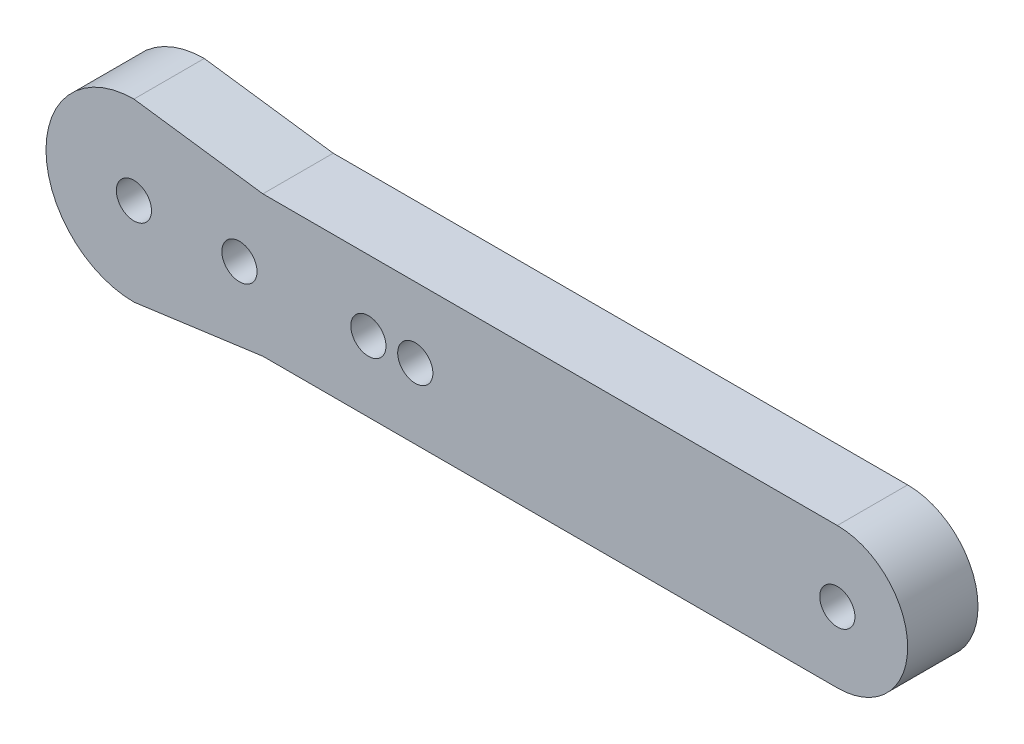
ISO-10303-21;
HEADER;
FILE_DESCRIPTION(('STEP AP214'),'2;1');
FILE_NAME('part.step','',(''),(''),'','','');
FILE_SCHEMA(('AUTOMOTIVE_DESIGN { 1 0 10303 214 1 1 1 1 }'));
ENDSEC;
DATA;
#1=APPLICATION_CONTEXT('core data for automotive mechanical design processes');
#2=APPLICATION_PROTOCOL_DEFINITION('international standard','automotive_design',2000,#1);
#3=PRODUCT_CONTEXT('',#1,'mechanical');
#4=PRODUCT('Part','Part','',(#3));
#5=PRODUCT_RELATED_PRODUCT_CATEGORY('part','',(#4));
#6=PRODUCT_DEFINITION_FORMATION('','',#4);
#7=PRODUCT_DEFINITION_CONTEXT('part definition',#1,'design');
#8=PRODUCT_DEFINITION('design','',#6,#7);
#9=PRODUCT_DEFINITION_SHAPE('','',#8);
#10=(LENGTH_UNIT() NAMED_UNIT(*) SI_UNIT(.MILLI.,.METRE.));
#11=(NAMED_UNIT(*) PLANE_ANGLE_UNIT() SI_UNIT($,.RADIAN.));
#12=(NAMED_UNIT(*) SI_UNIT($,.STERADIAN.) SOLID_ANGLE_UNIT());
#13=UNCERTAINTY_MEASURE_WITH_UNIT(LENGTH_MEASURE(1.E-05),#10,'distance_accuracy_value','');
#14=(GEOMETRIC_REPRESENTATION_CONTEXT(3) GLOBAL_UNCERTAINTY_ASSIGNED_CONTEXT((#13)) GLOBAL_UNIT_ASSIGNED_CONTEXT((#10,
#11,#12)) REPRESENTATION_CONTEXT('',''));
#15=CARTESIAN_POINT('',(0.,0.,0.));
#16=DIRECTION('',(0.,0.,1.));
#17=DIRECTION('',(1.,0.,0.));
#18=AXIS2_PLACEMENT_3D('',#15,#16,#17);
#19=CARTESIAN_POINT('',(0.,-6.,6.));
#20=DIRECTION('',(0.,1.,0.));
#21=DIRECTION('',(0.,0.,1.));
#22=AXIS2_PLACEMENT_3D('',#19,#20,#21);
#23=PLANE('',#22);
#24=DIRECTION('',(0.,0.,-1.));
#25=VECTOR('',#24,1.);
#26=CARTESIAN_POINT('',(11.,-6.,29.8170107276291));
#27=LINE('',#26,#25);
#28=CARTESIAN_POINT('',(11.,-6.,6.));
#29=VERTEX_POINT('',#28);
#30=CARTESIAN_POINT('',(11.,-6.,0.));
#31=VERTEX_POINT('',#30);
#32=EDGE_CURVE('E129',#29,#31,#27,.T.);
#33=ORIENTED_EDGE('',*,*,#32,.T.);
#34=DIRECTION('',(1.,0.,0.));
#35=VECTOR('',#34,1.);
#36=CARTESIAN_POINT('',(0.,-6.,0.));
#37=LINE('',#36,#35);
#38=CARTESIAN_POINT('',(60.,-6.,0.));
#39=VERTEX_POINT('',#38);
#40=EDGE_CURVE('E181',#31,#39,#37,.T.);
#41=ORIENTED_EDGE('',*,*,#40,.T.);
#42=DIRECTION('',(0.,0.,-1.));
#43=VECTOR('',#42,1.);
#44=CARTESIAN_POINT('',(60.,-6.,6.));
#45=LINE('',#44,#43);
#46=CARTESIAN_POINT('',(60.,-6.,6.));
#47=VERTEX_POINT('',#46);
#48=EDGE_CURVE('E11',#47,#39,#45,.T.);
#49=ORIENTED_EDGE('',*,*,#48,.F.);
#50=DIRECTION('',(1.,0.,0.));
#51=VECTOR('',#50,1.);
#52=CARTESIAN_POINT('',(0.,-6.,6.));
#53=LINE('',#52,#51);
#54=EDGE_CURVE('E70',#29,#47,#53,.T.);
#55=ORIENTED_EDGE('',*,*,#54,.F.);
#56=EDGE_LOOP('',(#33,#41,#49,#55));
#57=FACE_BOUND('',#56,.T.);
#58=ADVANCED_FACE('F47',(#57),#23,.F.);
#59=CARTESIAN_POINT('',(0.,6.,6.));
#60=DIRECTION('',(0.,-1.,0.));
#61=DIRECTION('',(0.,0.,-1.));
#62=AXIS2_PLACEMENT_3D('',#59,#60,#61);
#63=PLANE('',#62);
#64=DIRECTION('',(0.,0.,-1.));
#65=VECTOR('',#64,1.);
#66=CARTESIAN_POINT('',(11.,6.,29.8170107276291));
#67=LINE('',#66,#65);
#68=CARTESIAN_POINT('',(11.,6.,6.));
#69=VERTEX_POINT('',#68);
#70=CARTESIAN_POINT('',(11.,6.,0.));
#71=VERTEX_POINT('',#70);
#72=EDGE_CURVE('E62',#69,#71,#67,.T.);
#73=ORIENTED_EDGE('',*,*,#72,.F.);
#74=DIRECTION('',(-1.,0.,0.));
#75=VECTOR('',#74,1.);
#76=CARTESIAN_POINT('',(0.,6.,6.));
#77=LINE('',#76,#75);
#78=CARTESIAN_POINT('',(60.,6.,6.));
#79=VERTEX_POINT('',#78);
#80=EDGE_CURVE('E127',#79,#69,#77,.T.);
#81=ORIENTED_EDGE('',*,*,#80,.F.);
#82=DIRECTION('',(0.,0.,-1.));
#83=VECTOR('',#82,1.);
#84=CARTESIAN_POINT('',(60.,6.,6.));
#85=LINE('',#84,#83);
#86=CARTESIAN_POINT('',(60.,6.,0.));
#87=VERTEX_POINT('',#86);
#88=EDGE_CURVE('E55',#79,#87,#85,.T.);
#89=ORIENTED_EDGE('',*,*,#88,.T.);
#90=DIRECTION('',(-1.,0.,0.));
#91=VECTOR('',#90,1.);
#92=CARTESIAN_POINT('',(0.,6.,0.));
#93=LINE('',#92,#91);
#94=EDGE_CURVE('E185',#87,#71,#93,.T.);
#95=ORIENTED_EDGE('',*,*,#94,.T.);
#96=EDGE_LOOP('',(#73,#81,#89,#95));
#97=FACE_BOUND('',#96,.T.);
#98=ADVANCED_FACE('F199',(#97),#63,.F.);
#99=CARTESIAN_POINT('',(60.,0.,6.));
#100=DIRECTION('',(0.,0.,-1.));
#101=DIRECTION('',(-1.,0.,0.));
#102=AXIS2_PLACEMENT_3D('',#99,#100,#101);
#103=CYLINDRICAL_SURFACE('',#102,6.);
#104=CARTESIAN_POINT('',(60.,0.,0.));
#105=DIRECTION('',(0.,0.,1.));
#106=DIRECTION('',(1.,0.,0.));
#107=AXIS2_PLACEMENT_3D('',#104,#105,#106);
#108=CIRCLE('',#107,6.);
#109=EDGE_CURVE('E191',#39,#87,#108,.T.);
#110=ORIENTED_EDGE('',*,*,#109,.T.);
#111=ORIENTED_EDGE('',*,*,#88,.F.);
#112=CARTESIAN_POINT('',(60.,0.,6.));
#113=DIRECTION('',(0.,0.,1.));
#114=DIRECTION('',(1.,0.,0.));
#115=AXIS2_PLACEMENT_3D('',#112,#113,#114);
#116=CIRCLE('',#115,6.);
#117=EDGE_CURVE('E184',#47,#79,#116,.T.);
#118=ORIENTED_EDGE('',*,*,#117,.F.);
#119=ORIENTED_EDGE('',*,*,#48,.T.);
#120=EDGE_LOOP('',(#110,#111,#118,#119));
#121=FACE_BOUND('',#120,.T.);
#122=ADVANCED_FACE('F215',(#121),#103,.T.);
#123=CARTESIAN_POINT('',(0.,0.,6.));
#124=DIRECTION('',(0.,0.,1.));
#125=DIRECTION('',(1.,0.,0.));
#126=AXIS2_PLACEMENT_3D('',#123,#124,#125);
#127=PLANE('',#126);
#128=ORIENTED_EDGE('',*,*,#80,.T.);
#129=DIRECTION('',(-0.990830168044299,0.135113204733313,0.));
#130=VECTOR('',#129,1.);
#131=CARTESIAN_POINT('',(0.,7.5,6.));
#132=LINE('',#131,#130);
#133=CARTESIAN_POINT('',(0.,7.5,6.));
#134=VERTEX_POINT('',#133);
#135=EDGE_CURVE('E114',#69,#134,#132,.T.);
#136=ORIENTED_EDGE('',*,*,#135,.T.);
#137=CARTESIAN_POINT('',(0.,0.,6.));
#138=DIRECTION('',(0.,0.,1.));
#139=DIRECTION('',(1.,0.,0.));
#140=AXIS2_PLACEMENT_3D('',#137,#138,#139);
#141=CIRCLE('',#140,7.5);
#142=CARTESIAN_POINT('',(0.,-7.5,6.));
#143=VERTEX_POINT('',#142);
#144=EDGE_CURVE('E102',#134,#143,#141,.T.);
#145=ORIENTED_EDGE('',*,*,#144,.T.);
#146=DIRECTION('',(0.990830168044299,0.135113204733313,0.));
#147=VECTOR('',#146,1.);
#148=CARTESIAN_POINT('',(0.,-7.5,6.));
#149=LINE('',#148,#147);
#150=EDGE_CURVE('E113',#143,#29,#149,.T.);
#151=ORIENTED_EDGE('',*,*,#150,.T.);
#152=ORIENTED_EDGE('',*,*,#54,.T.);
#153=ORIENTED_EDGE('',*,*,#117,.T.);
#154=EDGE_LOOP('',(#128,#136,#145,#151,#152,#153));
#155=FACE_BOUND('',#154,.T.);
#156=CARTESIAN_POINT('',(0.,0.,6.));
#157=DIRECTION('',(0.,0.,1.));
#158=DIRECTION('',(1.,0.,0.));
#159=AXIS2_PLACEMENT_3D('',#156,#157,#158);
#160=CIRCLE('',#159,1.5);
#161=CARTESIAN_POINT('',(1.5,0.,6.));
#162=VERTEX_POINT('',#161);
#163=EDGE_CURVE('E141',#162,#162,#160,.T.);
#164=ORIENTED_EDGE('',*,*,#163,.F.);
#165=EDGE_LOOP('',(#164));
#166=FACE_BOUND('',#165,.T.);
#167=CARTESIAN_POINT('',(60.,0.,6.));
#168=DIRECTION('',(0.,0.,1.));
#169=DIRECTION('',(1.,0.,0.));
#170=AXIS2_PLACEMENT_3D('',#167,#168,#169);
#171=CIRCLE('',#170,1.5);
#172=CARTESIAN_POINT('',(61.5,0.,6.));
#173=VERTEX_POINT('',#172);
#174=EDGE_CURVE('E149',#173,#173,#171,.T.);
#175=ORIENTED_EDGE('',*,*,#174,.F.);
#176=EDGE_LOOP('',(#175));
#177=FACE_BOUND('',#176,.T.);
#178=CARTESIAN_POINT('',(9.,0.,6.));
#179=DIRECTION('',(0.,0.,1.));
#180=DIRECTION('',(1.,0.,0.));
#181=AXIS2_PLACEMENT_3D('',#178,#179,#180);
#182=CIRCLE('',#181,1.5);
#183=CARTESIAN_POINT('',(10.5,0.,6.));
#184=VERTEX_POINT('',#183);
#185=EDGE_CURVE('E157',#184,#184,#182,.T.);
#186=ORIENTED_EDGE('',*,*,#185,.F.);
#187=EDGE_LOOP('',(#186));
#188=FACE_BOUND('',#187,.T.);
#189=CARTESIAN_POINT('',(20.,0.,6.));
#190=DIRECTION('',(0.,0.,1.));
#191=DIRECTION('',(1.,0.,0.));
#192=AXIS2_PLACEMENT_3D('',#189,#190,#191);
#193=CIRCLE('',#192,1.5);
#194=CARTESIAN_POINT('',(21.5,0.,6.));
#195=VERTEX_POINT('',#194);
#196=EDGE_CURVE('E165',#195,#195,#193,.T.);
#197=ORIENTED_EDGE('',*,*,#196,.F.);
#198=EDGE_LOOP('',(#197));
#199=FACE_BOUND('',#198,.T.);
#200=CARTESIAN_POINT('',(24.,0.,6.));
#201=DIRECTION('',(0.,0.,1.));
#202=DIRECTION('',(1.,0.,0.));
#203=AXIS2_PLACEMENT_3D('',#200,#201,#202);
#204=CIRCLE('',#203,1.5);
#205=CARTESIAN_POINT('',(25.5,0.,6.));
#206=VERTEX_POINT('',#205);
#207=EDGE_CURVE('E173',#206,#206,#204,.T.);
#208=ORIENTED_EDGE('',*,*,#207,.F.);
#209=EDGE_LOOP('',(#208));
#210=FACE_BOUND('',#209,.T.);
#211=ADVANCED_FACE('F125',(#155,#166,#177,#188,#199,#210),#127,.T.);
#212=CARTESIAN_POINT('',(0.,0.,0.));
#213=DIRECTION('',(0.,0.,1.));
#214=DIRECTION('',(1.,0.,0.));
#215=AXIS2_PLACEMENT_3D('',#212,#213,#214);
#216=PLANE('',#215);
#217=DIRECTION('',(-0.990830168044299,0.135113204733313,0.));
#218=VECTOR('',#217,1.);
#219=CARTESIAN_POINT('',(0.,7.5,0.));
#220=LINE('',#219,#218);
#221=CARTESIAN_POINT('',(0.,7.5,0.));
#222=VERTEX_POINT('',#221);
#223=EDGE_CURVE('E120',#71,#222,#220,.T.);
#224=ORIENTED_EDGE('',*,*,#223,.F.);
#225=ORIENTED_EDGE('',*,*,#94,.F.);
#226=ORIENTED_EDGE('',*,*,#109,.F.);
#227=ORIENTED_EDGE('',*,*,#40,.F.);
#228=DIRECTION('',(0.990830168044299,0.135113204733313,0.));
#229=VECTOR('',#228,1.);
#230=CARTESIAN_POINT('',(0.,-7.5,0.));
#231=LINE('',#230,#229);
#232=CARTESIAN_POINT('',(0.,-7.5,0.));
#233=VERTEX_POINT('',#232);
#234=EDGE_CURVE('E134',#233,#31,#231,.T.);
#235=ORIENTED_EDGE('',*,*,#234,.F.);
#236=CARTESIAN_POINT('',(0.,0.,0.));
#237=DIRECTION('',(0.,0.,1.));
#238=DIRECTION('',(1.,0.,0.));
#239=AXIS2_PLACEMENT_3D('',#236,#237,#238);
#240=CIRCLE('',#239,7.5);
#241=EDGE_CURVE('E123',#222,#233,#240,.T.);
#242=ORIENTED_EDGE('',*,*,#241,.F.);
#243=EDGE_LOOP('',(#224,#225,#226,#227,#235,#242));
#244=FACE_BOUND('',#243,.T.);
#245=CARTESIAN_POINT('',(0.,0.,0.));
#246=DIRECTION('',(0.,0.,1.));
#247=DIRECTION('',(1.,0.,0.));
#248=AXIS2_PLACEMENT_3D('',#245,#246,#247);
#249=CIRCLE('',#248,1.5);
#250=CARTESIAN_POINT('',(1.5,0.,0.));
#251=VERTEX_POINT('',#250);
#252=EDGE_CURVE('E145',#251,#251,#249,.T.);
#253=ORIENTED_EDGE('',*,*,#252,.T.);
#254=EDGE_LOOP('',(#253));
#255=FACE_BOUND('',#254,.T.);
#256=CARTESIAN_POINT('',(60.,0.,0.));
#257=DIRECTION('',(0.,0.,1.));
#258=DIRECTION('',(1.,0.,0.));
#259=AXIS2_PLACEMENT_3D('',#256,#257,#258);
#260=CIRCLE('',#259,1.5);
#261=CARTESIAN_POINT('',(61.5,0.,0.));
#262=VERTEX_POINT('',#261);
#263=EDGE_CURVE('E153',#262,#262,#260,.T.);
#264=ORIENTED_EDGE('',*,*,#263,.T.);
#265=EDGE_LOOP('',(#264));
#266=FACE_BOUND('',#265,.T.);
#267=CARTESIAN_POINT('',(9.,0.,0.));
#268=DIRECTION('',(0.,0.,1.));
#269=DIRECTION('',(1.,0.,0.));
#270=AXIS2_PLACEMENT_3D('',#267,#268,#269);
#271=CIRCLE('',#270,1.5);
#272=CARTESIAN_POINT('',(10.5,0.,0.));
#273=VERTEX_POINT('',#272);
#274=EDGE_CURVE('E161',#273,#273,#271,.T.);
#275=ORIENTED_EDGE('',*,*,#274,.T.);
#276=EDGE_LOOP('',(#275));
#277=FACE_BOUND('',#276,.T.);
#278=CARTESIAN_POINT('',(20.,0.,0.));
#279=DIRECTION('',(0.,0.,1.));
#280=DIRECTION('',(1.,0.,0.));
#281=AXIS2_PLACEMENT_3D('',#278,#279,#280);
#282=CIRCLE('',#281,1.5);
#283=CARTESIAN_POINT('',(21.5,0.,0.));
#284=VERTEX_POINT('',#283);
#285=EDGE_CURVE('E169',#284,#284,#282,.T.);
#286=ORIENTED_EDGE('',*,*,#285,.T.);
#287=EDGE_LOOP('',(#286));
#288=FACE_BOUND('',#287,.T.);
#289=CARTESIAN_POINT('',(24.,0.,0.));
#290=DIRECTION('',(0.,0.,1.));
#291=DIRECTION('',(1.,0.,0.));
#292=AXIS2_PLACEMENT_3D('',#289,#290,#291);
#293=CIRCLE('',#292,1.5);
#294=CARTESIAN_POINT('',(25.5,0.,0.));
#295=VERTEX_POINT('',#294);
#296=EDGE_CURVE('E177',#295,#295,#293,.T.);
#297=ORIENTED_EDGE('',*,*,#296,.T.);
#298=EDGE_LOOP('',(#297));
#299=FACE_BOUND('',#298,.T.);
#300=ADVANCED_FACE('F204',(#244,#255,#266,#277,#288,#299),#216,.F.);
#301=CARTESIAN_POINT('',(24.,0.,6.));
#302=DIRECTION('',(0.,0.,1.));
#303=DIRECTION('',(1.,0.,0.));
#304=AXIS2_PLACEMENT_3D('',#301,#302,#303);
#305=CYLINDRICAL_SURFACE('',#304,1.5);
#306=ORIENTED_EDGE('',*,*,#296,.F.);
#307=EDGE_LOOP('',(#306));
#308=FACE_BOUND('',#307,.T.);
#309=ORIENTED_EDGE('',*,*,#207,.T.);
#310=EDGE_LOOP('',(#309));
#311=FACE_BOUND('',#310,.T.);
#312=ADVANCED_FACE('F246',(#308,#311),#305,.F.);
#313=CARTESIAN_POINT('',(20.,0.,6.));
#314=DIRECTION('',(0.,0.,1.));
#315=DIRECTION('',(1.,0.,0.));
#316=AXIS2_PLACEMENT_3D('',#313,#314,#315);
#317=CYLINDRICAL_SURFACE('',#316,1.5);
#318=ORIENTED_EDGE('',*,*,#285,.F.);
#319=EDGE_LOOP('',(#318));
#320=FACE_BOUND('',#319,.T.);
#321=ORIENTED_EDGE('',*,*,#196,.T.);
#322=EDGE_LOOP('',(#321));
#323=FACE_BOUND('',#322,.T.);
#324=ADVANCED_FACE('F254',(#320,#323),#317,.F.);
#325=CARTESIAN_POINT('',(9.,0.,6.));
#326=DIRECTION('',(0.,0.,1.));
#327=DIRECTION('',(1.,0.,0.));
#328=AXIS2_PLACEMENT_3D('',#325,#326,#327);
#329=CYLINDRICAL_SURFACE('',#328,1.5);
#330=ORIENTED_EDGE('',*,*,#274,.F.);
#331=EDGE_LOOP('',(#330));
#332=FACE_BOUND('',#331,.T.);
#333=ORIENTED_EDGE('',*,*,#185,.T.);
#334=EDGE_LOOP('',(#333));
#335=FACE_BOUND('',#334,.T.);
#336=ADVANCED_FACE('F263',(#332,#335),#329,.F.);
#337=CARTESIAN_POINT('',(60.,0.,6.));
#338=DIRECTION('',(0.,0.,1.));
#339=DIRECTION('',(1.,0.,0.));
#340=AXIS2_PLACEMENT_3D('',#337,#338,#339);
#341=CYLINDRICAL_SURFACE('',#340,1.5);
#342=ORIENTED_EDGE('',*,*,#263,.F.);
#343=EDGE_LOOP('',(#342));
#344=FACE_BOUND('',#343,.T.);
#345=ORIENTED_EDGE('',*,*,#174,.T.);
#346=EDGE_LOOP('',(#345));
#347=FACE_BOUND('',#346,.T.);
#348=ADVANCED_FACE('F272',(#344,#347),#341,.F.);
#349=CARTESIAN_POINT('',(0.,0.,6.));
#350=DIRECTION('',(0.,0.,1.));
#351=DIRECTION('',(1.,0.,0.));
#352=AXIS2_PLACEMENT_3D('',#349,#350,#351);
#353=CYLINDRICAL_SURFACE('',#352,1.5);
#354=ORIENTED_EDGE('',*,*,#252,.F.);
#355=EDGE_LOOP('',(#354));
#356=FACE_BOUND('',#355,.T.);
#357=ORIENTED_EDGE('',*,*,#163,.T.);
#358=EDGE_LOOP('',(#357));
#359=FACE_BOUND('',#358,.T.);
#360=ADVANCED_FACE('F281',(#356,#359),#353,.F.);
#361=CARTESIAN_POINT('',(0.,7.5,29.8170107276291));
#362=DIRECTION('',(-0.135113204733313,-0.990830168044299,0.));
#363=DIRECTION('',(0.990830168044299,-0.135113204733313,0.));
#364=AXIS2_PLACEMENT_3D('',#361,#362,#363);
#365=PLANE('',#364);
#366=ORIENTED_EDGE('',*,*,#135,.F.);
#367=ORIENTED_EDGE('',*,*,#72,.T.);
#368=ORIENTED_EDGE('',*,*,#223,.T.);
#369=DIRECTION('',(0.,0.,-1.));
#370=VECTOR('',#369,1.);
#371=CARTESIAN_POINT('',(0.,7.5,29.8170107276291));
#372=LINE('',#371,#370);
#373=EDGE_CURVE('E106',#134,#222,#372,.T.);
#374=ORIENTED_EDGE('',*,*,#373,.F.);
#375=EDGE_LOOP('',(#366,#367,#368,#374));
#376=FACE_BOUND('',#375,.T.);
#377=ADVANCED_FACE('F118',(#376),#365,.F.);
#378=CARTESIAN_POINT('',(0.,0.,29.8170107276291));
#379=DIRECTION('',(0.,0.,-1.));
#380=DIRECTION('',(-1.,0.,0.));
#381=AXIS2_PLACEMENT_3D('',#378,#379,#380);
#382=CYLINDRICAL_SURFACE('',#381,7.5);
#383=ORIENTED_EDGE('',*,*,#144,.F.);
#384=ORIENTED_EDGE('',*,*,#373,.T.);
#385=ORIENTED_EDGE('',*,*,#241,.T.);
#386=DIRECTION('',(0.,0.,-1.));
#387=VECTOR('',#386,1.);
#388=CARTESIAN_POINT('',(0.,-7.5,29.8170107276291));
#389=LINE('',#388,#387);
#390=EDGE_CURVE('E108',#143,#233,#389,.T.);
#391=ORIENTED_EDGE('',*,*,#390,.F.);
#392=EDGE_LOOP('',(#383,#384,#385,#391));
#393=FACE_BOUND('',#392,.T.);
#394=ADVANCED_FACE('F104',(#393),#382,.T.);
#395=CARTESIAN_POINT('',(0.,-7.5,29.8170107276291));
#396=DIRECTION('',(-0.135113204733313,0.990830168044299,0.));
#397=DIRECTION('',(-0.990830168044299,-0.135113204733313,0.));
#398=AXIS2_PLACEMENT_3D('',#395,#396,#397);
#399=PLANE('',#398);
#400=ORIENTED_EDGE('',*,*,#150,.F.);
#401=ORIENTED_EDGE('',*,*,#390,.T.);
#402=ORIENTED_EDGE('',*,*,#234,.T.);
#403=ORIENTED_EDGE('',*,*,#32,.F.);
#404=EDGE_LOOP('',(#400,#401,#402,#403));
#405=FACE_BOUND('',#404,.T.);
#406=ADVANCED_FACE('F213',(#405),#399,.F.);
#407=CLOSED_SHELL('',(#58,#98,#122,#211,#300,#312,#324,#336,#348,#360,#377,#394,#406));
#408=MANIFOLD_SOLID_BREP('B2',#407);
#409=ADVANCED_BREP_SHAPE_REPRESENTATION('',(#18,#408),#14);
#410=SHAPE_DEFINITION_REPRESENTATION(#9,#409);
ENDSEC;
END-ISO-10303-21;
